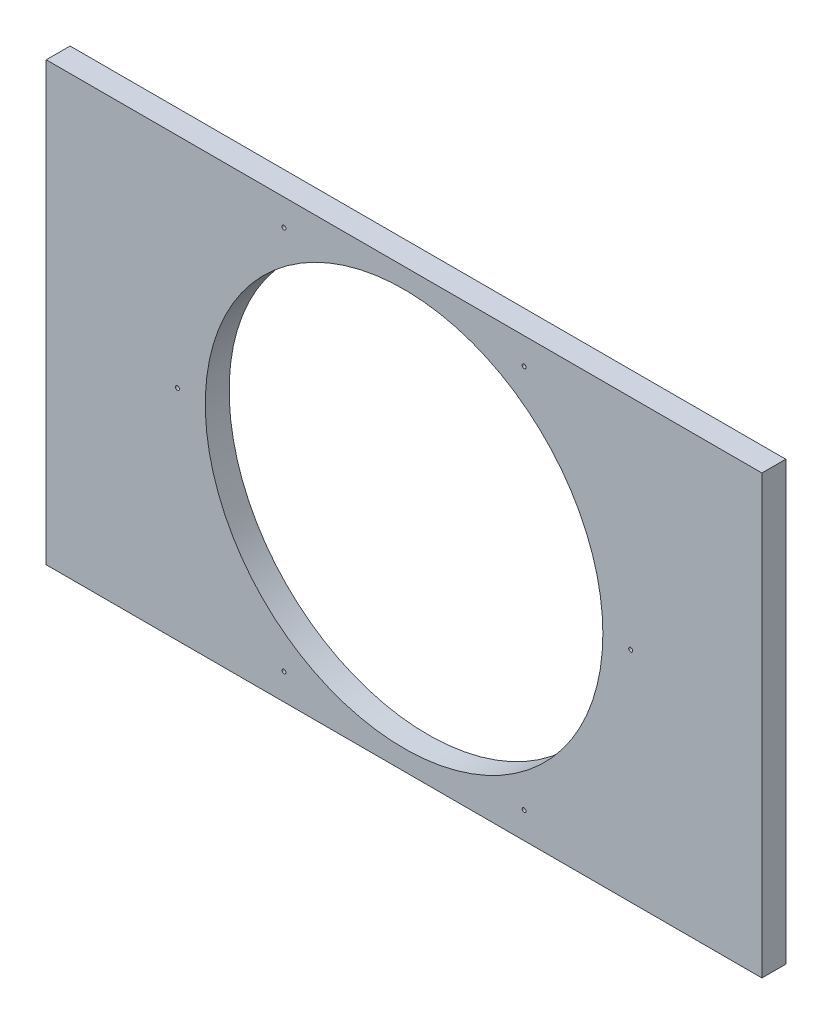
ISO-10303-21;
HEADER;
FILE_DESCRIPTION(('STEP AP214'),'2;1');
FILE_NAME('part.step','',(''),(''),'','','');
FILE_SCHEMA(('AUTOMOTIVE_DESIGN { 1 0 10303 214 1 1 1 1 }'));
ENDSEC;
DATA;
#1=APPLICATION_CONTEXT('core data for automotive mechanical design processes');
#2=APPLICATION_PROTOCOL_DEFINITION('international standard','automotive_design',2000,#1);
#3=PRODUCT_CONTEXT('',#1,'mechanical');
#4=PRODUCT('Part','Part','',(#3));
#5=PRODUCT_RELATED_PRODUCT_CATEGORY('part','',(#4));
#6=PRODUCT_DEFINITION_FORMATION('','',#4);
#7=PRODUCT_DEFINITION_CONTEXT('part definition',#1,'design');
#8=PRODUCT_DEFINITION('design','',#6,#7);
#9=PRODUCT_DEFINITION_SHAPE('','',#8);
#10=(LENGTH_UNIT() NAMED_UNIT(*) SI_UNIT(.MILLI.,.METRE.));
#11=(NAMED_UNIT(*) PLANE_ANGLE_UNIT() SI_UNIT($,.RADIAN.));
#12=(NAMED_UNIT(*) SI_UNIT($,.STERADIAN.) SOLID_ANGLE_UNIT());
#13=UNCERTAINTY_MEASURE_WITH_UNIT(LENGTH_MEASURE(1.E-05),#10,'distance_accuracy_value','');
#14=(GEOMETRIC_REPRESENTATION_CONTEXT(3) GLOBAL_UNCERTAINTY_ASSIGNED_CONTEXT((#13)) GLOBAL_UNIT_ASSIGNED_CONTEXT((#10,
#11,#12)) REPRESENTATION_CONTEXT('',''));
#15=CARTESIAN_POINT('',(0.,0.,0.));
#16=DIRECTION('',(0.,0.,1.));
#17=DIRECTION('',(1.,0.,0.));
#18=AXIS2_PLACEMENT_3D('',#15,#16,#17);
#19=CARTESIAN_POINT('',(0.,0.,6.));
#20=DIRECTION('',(-1.,0.,0.));
#21=DIRECTION('',(0.,0.,1.));
#22=AXIS2_PLACEMENT_3D('',#19,#20,#21);
#23=PLANE('',#22);
#24=DIRECTION('',(0.,1.,0.));
#25=VECTOR('',#24,1.);
#26=CARTESIAN_POINT('',(0.,0.,0.));
#27=LINE('',#26,#25);
#28=CARTESIAN_POINT('',(0.,0.,0.));
#29=VERTEX_POINT('',#28);
#30=CARTESIAN_POINT('',(0.,110.,0.));
#31=VERTEX_POINT('',#30);
#32=EDGE_CURVE('E98',#29,#31,#27,.T.);
#33=ORIENTED_EDGE('',*,*,#32,.F.);
#34=DIRECTION('',(0.,0.,-1.));
#35=VECTOR('',#34,1.);
#36=CARTESIAN_POINT('',(0.,0.,6.));
#37=LINE('',#36,#35);
#38=CARTESIAN_POINT('',(0.,0.,6.));
#39=VERTEX_POINT('',#38);
#40=EDGE_CURVE('E11',#39,#29,#37,.T.);
#41=ORIENTED_EDGE('',*,*,#40,.F.);
#42=DIRECTION('',(0.,1.,0.));
#43=VECTOR('',#42,1.);
#44=CARTESIAN_POINT('',(0.,0.,6.));
#45=LINE('',#44,#43);
#46=CARTESIAN_POINT('',(0.,110.,6.));
#47=VERTEX_POINT('',#46);
#48=EDGE_CURVE('E92',#39,#47,#45,.T.);
#49=ORIENTED_EDGE('',*,*,#48,.T.);
#50=DIRECTION('',(0.,0.,-1.));
#51=VECTOR('',#50,1.);
#52=CARTESIAN_POINT('',(0.,110.,6.));
#53=LINE('',#52,#51);
#54=EDGE_CURVE('E35',#47,#31,#53,.T.);
#55=ORIENTED_EDGE('',*,*,#54,.T.);
#56=EDGE_LOOP('',(#33,#41,#49,#55));
#57=FACE_BOUND('',#56,.T.);
#58=ADVANCED_FACE('F32',(#57),#23,.T.);
#59=CARTESIAN_POINT('',(0.,0.,6.));
#60=DIRECTION('',(0.,1.,0.));
#61=DIRECTION('',(0.,0.,1.));
#62=AXIS2_PLACEMENT_3D('',#59,#60,#61);
#63=PLANE('',#62);
#64=DIRECTION('',(1.,0.,0.));
#65=VECTOR('',#64,1.);
#66=CARTESIAN_POINT('',(0.,0.,0.));
#67=LINE('',#66,#65);
#68=CARTESIAN_POINT('',(180.,0.,0.));
#69=VERTEX_POINT('',#68);
#70=EDGE_CURVE('E65',#29,#69,#67,.T.);
#71=ORIENTED_EDGE('',*,*,#70,.T.);
#72=DIRECTION('',(0.,0.,-1.));
#73=VECTOR('',#72,1.);
#74=CARTESIAN_POINT('',(180.,0.,6.));
#75=LINE('',#74,#73);
#76=CARTESIAN_POINT('',(180.,0.,6.));
#77=VERTEX_POINT('',#76);
#78=EDGE_CURVE('E41',#77,#69,#75,.T.);
#79=ORIENTED_EDGE('',*,*,#78,.F.);
#80=DIRECTION('',(1.,0.,0.));
#81=VECTOR('',#80,1.);
#82=CARTESIAN_POINT('',(0.,0.,6.));
#83=LINE('',#82,#81);
#84=EDGE_CURVE('E82',#39,#77,#83,.T.);
#85=ORIENTED_EDGE('',*,*,#84,.F.);
#86=ORIENTED_EDGE('',*,*,#40,.T.);
#87=EDGE_LOOP('',(#71,#79,#85,#86));
#88=FACE_BOUND('',#87,.T.);
#89=ADVANCED_FACE('F109',(#88),#63,.F.);
#90=CARTESIAN_POINT('',(180.,0.,6.));
#91=DIRECTION('',(-1.,0.,0.));
#92=DIRECTION('',(0.,0.,1.));
#93=AXIS2_PLACEMENT_3D('',#90,#91,#92);
#94=PLANE('',#93);
#95=DIRECTION('',(0.,1.,0.));
#96=VECTOR('',#95,1.);
#97=CARTESIAN_POINT('',(180.,0.,0.));
#98=LINE('',#97,#96);
#99=CARTESIAN_POINT('',(180.,110.,0.));
#100=VERTEX_POINT('',#99);
#101=EDGE_CURVE('E89',#69,#100,#98,.T.);
#102=ORIENTED_EDGE('',*,*,#101,.T.);
#103=DIRECTION('',(0.,0.,-1.));
#104=VECTOR('',#103,1.);
#105=CARTESIAN_POINT('',(180.,110.,6.));
#106=LINE('',#105,#104);
#107=CARTESIAN_POINT('',(180.,110.,6.));
#108=VERTEX_POINT('',#107);
#109=EDGE_CURVE('E86',#108,#100,#106,.T.);
#110=ORIENTED_EDGE('',*,*,#109,.F.);
#111=DIRECTION('',(0.,1.,0.));
#112=VECTOR('',#111,1.);
#113=CARTESIAN_POINT('',(180.,0.,6.));
#114=LINE('',#113,#112);
#115=EDGE_CURVE('E77',#77,#108,#114,.T.);
#116=ORIENTED_EDGE('',*,*,#115,.F.);
#117=ORIENTED_EDGE('',*,*,#78,.T.);
#118=EDGE_LOOP('',(#102,#110,#116,#117));
#119=FACE_BOUND('',#118,.T.);
#120=ADVANCED_FACE('F87',(#119),#94,.F.);
#121=CARTESIAN_POINT('',(0.,110.,6.));
#122=DIRECTION('',(0.,1.,0.));
#123=DIRECTION('',(0.,0.,1.));
#124=AXIS2_PLACEMENT_3D('',#121,#122,#123);
#125=PLANE('',#124);
#126=DIRECTION('',(1.,0.,0.));
#127=VECTOR('',#126,1.);
#128=CARTESIAN_POINT('',(0.,110.,0.));
#129=LINE('',#128,#127);
#130=EDGE_CURVE('E101',#31,#100,#129,.T.);
#131=ORIENTED_EDGE('',*,*,#130,.F.);
#132=ORIENTED_EDGE('',*,*,#54,.F.);
#133=DIRECTION('',(1.,0.,0.));
#134=VECTOR('',#133,1.);
#135=CARTESIAN_POINT('',(0.,110.,6.));
#136=LINE('',#135,#134);
#137=EDGE_CURVE('E81',#47,#108,#136,.T.);
#138=ORIENTED_EDGE('',*,*,#137,.T.);
#139=ORIENTED_EDGE('',*,*,#109,.T.);
#140=EDGE_LOOP('',(#131,#132,#138,#139));
#141=FACE_BOUND('',#140,.T.);
#142=ADVANCED_FACE('F91',(#141),#125,.T.);
#143=CARTESIAN_POINT('',(0.,0.,6.));
#144=DIRECTION('',(0.,0.,-1.));
#145=DIRECTION('',(-1.,0.,0.));
#146=AXIS2_PLACEMENT_3D('',#143,#144,#145);
#147=PLANE('',#146);
#148=CARTESIAN_POINT('',(33.,55.,6.));
#149=DIRECTION('',(0.,0.,-1.));
#150=DIRECTION('',(-1.,0.,0.));
#151=AXIS2_PLACEMENT_3D('',#148,#149,#150);
#152=CIRCLE('',#151,0.499999999999999);
#153=CARTESIAN_POINT('',(32.5,55.,6.));
#154=VERTEX_POINT('',#153);
#155=EDGE_CURVE('E167',#154,#154,#152,.F.);
#156=ORIENTED_EDGE('',*,*,#155,.F.);
#157=EDGE_LOOP('',(#156));
#158=FACE_BOUND('',#157,.T.);
#159=CARTESIAN_POINT('',(59.7946019387074,6.66125851908362,6.));
#160=DIRECTION('',(0.,0.,-1.));
#161=DIRECTION('',(-1.,0.,0.));
#162=AXIS2_PLACEMENT_3D('',#159,#160,#161);
#163=CIRCLE('',#162,0.499999999999999);
#164=CARTESIAN_POINT('',(59.2946019387074,6.66125851908362,6.));
#165=VERTEX_POINT('',#164);
#166=EDGE_CURVE('E171',#165,#165,#163,.F.);
#167=ORIENTED_EDGE('',*,*,#166,.F.);
#168=EDGE_LOOP('',(#167));
#169=FACE_BOUND('',#168,.T.);
#170=CARTESIAN_POINT('',(120.205398061292,6.66125851908321,6.));
#171=DIRECTION('',(0.,0.,-1.));
#172=DIRECTION('',(-1.,0.,0.));
#173=AXIS2_PLACEMENT_3D('',#170,#171,#172);
#174=CIRCLE('',#173,0.499999999999999);
#175=CARTESIAN_POINT('',(119.705398061292,6.66125851908321,6.));
#176=VERTEX_POINT('',#175);
#177=EDGE_CURVE('E180',#176,#176,#174,.F.);
#178=ORIENTED_EDGE('',*,*,#177,.F.);
#179=EDGE_LOOP('',(#178));
#180=FACE_BOUND('',#179,.T.);
#181=CARTESIAN_POINT('',(147.,55.,6.));
#182=DIRECTION('',(0.,0.,-1.));
#183=DIRECTION('',(-1.,0.,0.));
#184=AXIS2_PLACEMENT_3D('',#181,#182,#183);
#185=CIRCLE('',#184,0.499999999999999);
#186=CARTESIAN_POINT('',(146.5,55.,6.));
#187=VERTEX_POINT('',#186);
#188=EDGE_CURVE('E186',#187,#187,#185,.F.);
#189=ORIENTED_EDGE('',*,*,#188,.F.);
#190=EDGE_LOOP('',(#189));
#191=FACE_BOUND('',#190,.T.);
#192=CARTESIAN_POINT('',(120.205398061293,103.338741480916,6.));
#193=DIRECTION('',(0.,0.,-1.));
#194=DIRECTION('',(-1.,0.,0.));
#195=AXIS2_PLACEMENT_3D('',#192,#193,#194);
#196=CIRCLE('',#195,0.499999999999999);
#197=CARTESIAN_POINT('',(119.705398061293,103.338741480916,6.));
#198=VERTEX_POINT('',#197);
#199=EDGE_CURVE('E192',#198,#198,#196,.F.);
#200=ORIENTED_EDGE('',*,*,#199,.F.);
#201=EDGE_LOOP('',(#200));
#202=FACE_BOUND('',#201,.T.);
#203=CARTESIAN_POINT('',(59.7946019387081,103.338741480917,6.));
#204=DIRECTION('',(0.,0.,-1.));
#205=DIRECTION('',(-1.,0.,0.));
#206=AXIS2_PLACEMENT_3D('',#203,#204,#205);
#207=CIRCLE('',#206,0.499999999999999);
#208=CARTESIAN_POINT('',(59.2946019387081,103.338741480917,6.));
#209=VERTEX_POINT('',#208);
#210=EDGE_CURVE('E198',#209,#209,#207,.F.);
#211=ORIENTED_EDGE('',*,*,#210,.F.);
#212=EDGE_LOOP('',(#211));
#213=FACE_BOUND('',#212,.T.);
#214=CARTESIAN_POINT('',(90.,55.,6.));
#215=DIRECTION('',(0.,0.,1.));
#216=DIRECTION('',(1.,0.,0.));
#217=AXIS2_PLACEMENT_3D('',#214,#215,#216);
#218=CIRCLE('',#217,50.);
#219=CARTESIAN_POINT('',(140.,55.,6.));
#220=VERTEX_POINT('',#219);
#221=EDGE_CURVE('E102',#220,#220,#218,.T.);
#222=ORIENTED_EDGE('',*,*,#221,.F.);
#223=EDGE_LOOP('',(#222));
#224=FACE_BOUND('',#223,.T.);
#225=ORIENTED_EDGE('',*,*,#48,.F.);
#226=ORIENTED_EDGE('',*,*,#84,.T.);
#227=ORIENTED_EDGE('',*,*,#115,.T.);
#228=ORIENTED_EDGE('',*,*,#137,.F.);
#229=EDGE_LOOP('',(#225,#226,#227,#228));
#230=FACE_BOUND('',#229,.T.);
#231=ADVANCED_FACE('F80',(#158,#169,#180,#191,#202,#213,#224,#230),#147,.F.);
#232=CARTESIAN_POINT('',(0.,0.,0.));
#233=DIRECTION('',(0.,0.,-1.));
#234=DIRECTION('',(-1.,0.,0.));
#235=AXIS2_PLACEMENT_3D('',#232,#233,#234);
#236=PLANE('',#235);
#237=CARTESIAN_POINT('',(33.,55.,0.));
#238=DIRECTION('',(0.,0.,1.));
#239=DIRECTION('',(1.,0.,0.));
#240=AXIS2_PLACEMENT_3D('',#237,#238,#239);
#241=CIRCLE('',#240,0.499999999999999);
#242=CARTESIAN_POINT('',(33.5,55.,0.));
#243=VERTEX_POINT('',#242);
#244=EDGE_CURVE('E165',#243,#243,#241,.T.);
#245=ORIENTED_EDGE('',*,*,#244,.T.);
#246=EDGE_LOOP('',(#245));
#247=FACE_BOUND('',#246,.T.);
#248=CARTESIAN_POINT('',(59.7946019387074,6.66125851908362,0.));
#249=DIRECTION('',(0.,0.,1.));
#250=DIRECTION('',(1.,0.,0.));
#251=AXIS2_PLACEMENT_3D('',#248,#249,#250);
#252=CIRCLE('',#251,0.499999999999999);
#253=CARTESIAN_POINT('',(60.2946019387074,6.66125851908362,0.));
#254=VERTEX_POINT('',#253);
#255=EDGE_CURVE('E168',#254,#254,#252,.T.);
#256=ORIENTED_EDGE('',*,*,#255,.T.);
#257=EDGE_LOOP('',(#256));
#258=FACE_BOUND('',#257,.T.);
#259=CARTESIAN_POINT('',(120.205398061292,6.66125851908321,0.));
#260=DIRECTION('',(0.,0.,1.));
#261=DIRECTION('',(1.,0.,0.));
#262=AXIS2_PLACEMENT_3D('',#259,#260,#261);
#263=CIRCLE('',#262,0.499999999999999);
#264=CARTESIAN_POINT('',(120.705398061292,6.66125851908321,0.));
#265=VERTEX_POINT('',#264);
#266=EDGE_CURVE('E177',#265,#265,#263,.T.);
#267=ORIENTED_EDGE('',*,*,#266,.T.);
#268=EDGE_LOOP('',(#267));
#269=FACE_BOUND('',#268,.T.);
#270=CARTESIAN_POINT('',(147.,55.,0.));
#271=DIRECTION('',(0.,0.,1.));
#272=DIRECTION('',(1.,0.,0.));
#273=AXIS2_PLACEMENT_3D('',#270,#271,#272);
#274=CIRCLE('',#273,0.499999999999999);
#275=CARTESIAN_POINT('',(147.5,55.,0.));
#276=VERTEX_POINT('',#275);
#277=EDGE_CURVE('E183',#276,#276,#274,.T.);
#278=ORIENTED_EDGE('',*,*,#277,.T.);
#279=EDGE_LOOP('',(#278));
#280=FACE_BOUND('',#279,.T.);
#281=CARTESIAN_POINT('',(120.205398061293,103.338741480916,0.));
#282=DIRECTION('',(0.,0.,1.));
#283=DIRECTION('',(1.,0.,0.));
#284=AXIS2_PLACEMENT_3D('',#281,#282,#283);
#285=CIRCLE('',#284,0.499999999999999);
#286=CARTESIAN_POINT('',(120.705398061293,103.338741480916,0.));
#287=VERTEX_POINT('',#286);
#288=EDGE_CURVE('E189',#287,#287,#285,.T.);
#289=ORIENTED_EDGE('',*,*,#288,.T.);
#290=EDGE_LOOP('',(#289));
#291=FACE_BOUND('',#290,.T.);
#292=CARTESIAN_POINT('',(59.7946019387081,103.338741480917,0.));
#293=DIRECTION('',(0.,0.,1.));
#294=DIRECTION('',(1.,0.,0.));
#295=AXIS2_PLACEMENT_3D('',#292,#293,#294);
#296=CIRCLE('',#295,0.499999999999999);
#297=CARTESIAN_POINT('',(60.2946019387081,103.338741480917,0.));
#298=VERTEX_POINT('',#297);
#299=EDGE_CURVE('E195',#298,#298,#296,.T.);
#300=ORIENTED_EDGE('',*,*,#299,.T.);
#301=EDGE_LOOP('',(#300));
#302=FACE_BOUND('',#301,.T.);
#303=CARTESIAN_POINT('',(90.,55.,0.));
#304=DIRECTION('',(0.,0.,1.));
#305=DIRECTION('',(1.,0.,0.));
#306=AXIS2_PLACEMENT_3D('',#303,#304,#305);
#307=CIRCLE('',#306,50.);
#308=CARTESIAN_POINT('',(140.,55.,0.));
#309=VERTEX_POINT('',#308);
#310=EDGE_CURVE('E201',#309,#309,#307,.T.);
#311=ORIENTED_EDGE('',*,*,#310,.T.);
#312=EDGE_LOOP('',(#311));
#313=FACE_BOUND('',#312,.T.);
#314=ORIENTED_EDGE('',*,*,#32,.T.);
#315=ORIENTED_EDGE('',*,*,#130,.T.);
#316=ORIENTED_EDGE('',*,*,#101,.F.);
#317=ORIENTED_EDGE('',*,*,#70,.F.);
#318=EDGE_LOOP('',(#314,#315,#316,#317));
#319=FACE_BOUND('',#318,.T.);
#320=ADVANCED_FACE('F107',(#247,#258,#269,#280,#291,#302,#313,#319),#236,.T.);
#321=CARTESIAN_POINT('',(90.,55.,6.));
#322=DIRECTION('',(0.,0.,-1.));
#323=DIRECTION('',(-1.,0.,0.));
#324=AXIS2_PLACEMENT_3D('',#321,#322,#323);
#325=CYLINDRICAL_SURFACE('',#324,50.);
#326=ORIENTED_EDGE('',*,*,#221,.T.);
#327=EDGE_LOOP('',(#326));
#328=FACE_BOUND('',#327,.T.);
#329=ORIENTED_EDGE('',*,*,#310,.F.);
#330=EDGE_LOOP('',(#329));
#331=FACE_BOUND('',#330,.T.);
#332=ADVANCED_FACE('F129',(#328,#331),#325,.F.);
#333=CARTESIAN_POINT('',(59.7946019387081,103.338741480917,40.));
#334=DIRECTION('',(0.,0.,-1.));
#335=DIRECTION('',(-1.,0.,0.));
#336=AXIS2_PLACEMENT_3D('',#333,#334,#335);
#337=CYLINDRICAL_SURFACE('',#336,0.499999999999999);
#338=ORIENTED_EDGE('',*,*,#299,.F.);
#339=EDGE_LOOP('',(#338));
#340=FACE_BOUND('',#339,.T.);
#341=ORIENTED_EDGE('',*,*,#210,.T.);
#342=EDGE_LOOP('',(#341));
#343=FACE_BOUND('',#342,.T.);
#344=ADVANCED_FACE('F136',(#340,#343),#337,.F.);
#345=CARTESIAN_POINT('',(120.205398061293,103.338741480916,40.));
#346=DIRECTION('',(0.,0.,-1.));
#347=DIRECTION('',(-1.,0.,0.));
#348=AXIS2_PLACEMENT_3D('',#345,#346,#347);
#349=CYLINDRICAL_SURFACE('',#348,0.499999999999999);
#350=ORIENTED_EDGE('',*,*,#288,.F.);
#351=EDGE_LOOP('',(#350));
#352=FACE_BOUND('',#351,.T.);
#353=ORIENTED_EDGE('',*,*,#199,.T.);
#354=EDGE_LOOP('',(#353));
#355=FACE_BOUND('',#354,.T.);
#356=ADVANCED_FACE('F140',(#352,#355),#349,.F.);
#357=CARTESIAN_POINT('',(147.,55.,40.));
#358=DIRECTION('',(0.,0.,-1.));
#359=DIRECTION('',(-1.,0.,0.));
#360=AXIS2_PLACEMENT_3D('',#357,#358,#359);
#361=CYLINDRICAL_SURFACE('',#360,0.499999999999999);
#362=ORIENTED_EDGE('',*,*,#277,.F.);
#363=EDGE_LOOP('',(#362));
#364=FACE_BOUND('',#363,.T.);
#365=ORIENTED_EDGE('',*,*,#188,.T.);
#366=EDGE_LOOP('',(#365));
#367=FACE_BOUND('',#366,.T.);
#368=ADVANCED_FACE('F144',(#364,#367),#361,.F.);
#369=CARTESIAN_POINT('',(120.205398061292,6.66125851908321,40.));
#370=DIRECTION('',(0.,0.,-1.));
#371=DIRECTION('',(-1.,0.,0.));
#372=AXIS2_PLACEMENT_3D('',#369,#370,#371);
#373=CYLINDRICAL_SURFACE('',#372,0.499999999999999);
#374=ORIENTED_EDGE('',*,*,#266,.F.);
#375=EDGE_LOOP('',(#374));
#376=FACE_BOUND('',#375,.T.);
#377=ORIENTED_EDGE('',*,*,#177,.T.);
#378=EDGE_LOOP('',(#377));
#379=FACE_BOUND('',#378,.T.);
#380=ADVANCED_FACE('F148',(#376,#379),#373,.F.);
#381=CARTESIAN_POINT('',(59.7946019387074,6.66125851908362,40.));
#382=DIRECTION('',(0.,0.,-1.));
#383=DIRECTION('',(-1.,0.,0.));
#384=AXIS2_PLACEMENT_3D('',#381,#382,#383);
#385=CYLINDRICAL_SURFACE('',#384,0.499999999999999);
#386=ORIENTED_EDGE('',*,*,#255,.F.);
#387=EDGE_LOOP('',(#386));
#388=FACE_BOUND('',#387,.T.);
#389=ORIENTED_EDGE('',*,*,#166,.T.);
#390=EDGE_LOOP('',(#389));
#391=FACE_BOUND('',#390,.T.);
#392=ADVANCED_FACE('F152',(#388,#391),#385,.F.);
#393=CARTESIAN_POINT('',(33.,55.,40.));
#394=DIRECTION('',(0.,0.,-1.));
#395=DIRECTION('',(-1.,0.,0.));
#396=AXIS2_PLACEMENT_3D('',#393,#394,#395);
#397=CYLINDRICAL_SURFACE('',#396,0.499999999999999);
#398=ORIENTED_EDGE('',*,*,#244,.F.);
#399=EDGE_LOOP('',(#398));
#400=FACE_BOUND('',#399,.T.);
#401=ORIENTED_EDGE('',*,*,#155,.T.);
#402=EDGE_LOOP('',(#401));
#403=FACE_BOUND('',#402,.T.);
#404=ADVANCED_FACE('F156',(#400,#403),#397,.F.);
#405=CLOSED_SHELL('',(#58,#89,#120,#142,#231,#320,#332,#344,#356,#368,#380,#392,#404));
#406=MANIFOLD_SOLID_BREP('B2',#405);
#407=ADVANCED_BREP_SHAPE_REPRESENTATION('',(#18,#406),#14);
#408=SHAPE_DEFINITION_REPRESENTATION(#9,#407);
ENDSEC;
END-ISO-10303-21;
